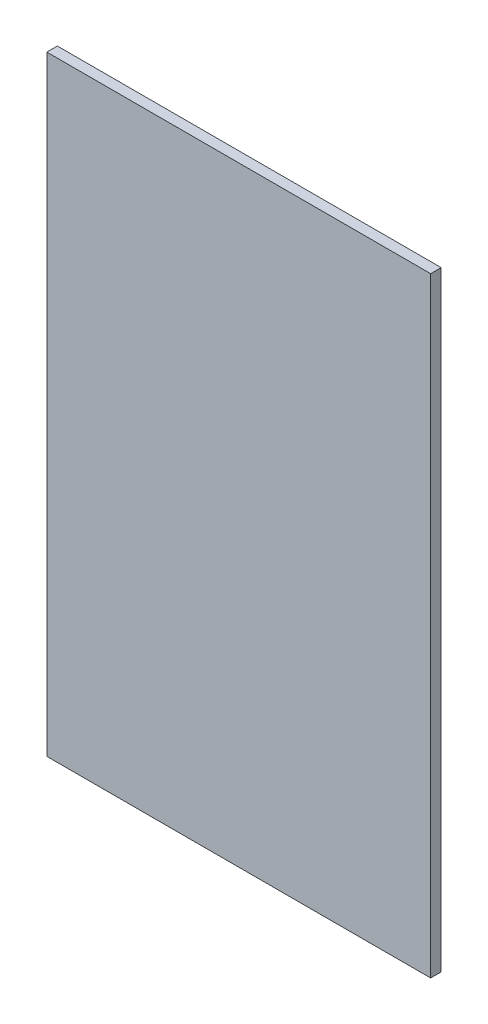
ISO-10303-21;
HEADER;
FILE_DESCRIPTION(('STEP AP214'),'2;1');
FILE_NAME('part.step','',(''),(''),'','','');
FILE_SCHEMA(('AUTOMOTIVE_DESIGN { 1 0 10303 214 1 1 1 1 }'));
ENDSEC;
DATA;
#1=APPLICATION_CONTEXT('core data for automotive mechanical design processes');
#2=APPLICATION_PROTOCOL_DEFINITION('international standard','automotive_design',2000,#1);
#3=PRODUCT_CONTEXT('',#1,'mechanical');
#4=PRODUCT('Part','Part','',(#3));
#5=PRODUCT_RELATED_PRODUCT_CATEGORY('part','',(#4));
#6=PRODUCT_DEFINITION_FORMATION('','',#4);
#7=PRODUCT_DEFINITION_CONTEXT('part definition',#1,'design');
#8=PRODUCT_DEFINITION('design','',#6,#7);
#9=PRODUCT_DEFINITION_SHAPE('','',#8);
#10=(LENGTH_UNIT() NAMED_UNIT(*) SI_UNIT(.MILLI.,.METRE.));
#11=(NAMED_UNIT(*) PLANE_ANGLE_UNIT() SI_UNIT($,.RADIAN.));
#12=(NAMED_UNIT(*) SI_UNIT($,.STERADIAN.) SOLID_ANGLE_UNIT());
#13=UNCERTAINTY_MEASURE_WITH_UNIT(LENGTH_MEASURE(1.E-05),#10,'distance_accuracy_value','');
#14=(GEOMETRIC_REPRESENTATION_CONTEXT(3) GLOBAL_UNCERTAINTY_ASSIGNED_CONTEXT((#13)) GLOBAL_UNIT_ASSIGNED_CONTEXT((#10,
#11,#12)) REPRESENTATION_CONTEXT('',''));
#15=CARTESIAN_POINT('',(0.,0.,0.));
#16=DIRECTION('',(0.,0.,1.));
#17=DIRECTION('',(1.,0.,0.));
#18=AXIS2_PLACEMENT_3D('',#15,#16,#17);
#19=CARTESIAN_POINT('',(-108.016712951374,44.5406064209275,10.));
#20=DIRECTION('',(1.,0.,0.));
#21=DIRECTION('',(0.,1.,0.));
#22=AXIS2_PLACEMENT_3D('',#19,#20,#21);
#23=PLANE('',#22);
#24=DIRECTION('',(0.,-1.,0.));
#25=VECTOR('',#24,1.);
#26=CARTESIAN_POINT('',(-108.016712951374,44.5406064209275,0.));
#27=LINE('',#26,#25);
#28=CARTESIAN_POINT('',(-108.016712951374,44.5406064209275,0.));
#29=VERTEX_POINT('',#28);
#30=CARTESIAN_POINT('',(-108.016712951374,-535.459393579072,0.));
#31=VERTEX_POINT('',#30);
#32=EDGE_CURVE('E95',#29,#31,#27,.T.);
#33=ORIENTED_EDGE('',*,*,#32,.T.);
#34=DIRECTION('',(0.,0.,-1.));
#35=VECTOR('',#34,1.);
#36=CARTESIAN_POINT('',(-108.016712951374,-535.459393579072,10.));
#37=LINE('',#36,#35);
#38=CARTESIAN_POINT('',(-108.016712951374,-535.459393579072,10.));
#39=VERTEX_POINT('',#38);
#40=EDGE_CURVE('E11',#39,#31,#37,.T.);
#41=ORIENTED_EDGE('',*,*,#40,.F.);
#42=DIRECTION('',(0.,-1.,0.));
#43=VECTOR('',#42,1.);
#44=CARTESIAN_POINT('',(-108.016712951374,44.5406064209275,10.));
#45=LINE('',#44,#43);
#46=CARTESIAN_POINT('',(-108.016712951374,44.5406064209275,10.));
#47=VERTEX_POINT('',#46);
#48=EDGE_CURVE('E83',#47,#39,#45,.T.);
#49=ORIENTED_EDGE('',*,*,#48,.F.);
#50=DIRECTION('',(0.,0.,-1.));
#51=VECTOR('',#50,1.);
#52=CARTESIAN_POINT('',(-108.016712951374,44.5406064209275,10.));
#53=LINE('',#52,#51);
#54=EDGE_CURVE('E91',#47,#29,#53,.T.);
#55=ORIENTED_EDGE('',*,*,#54,.T.);
#56=EDGE_LOOP('',(#33,#41,#49,#55));
#57=FACE_BOUND('',#56,.T.);
#58=ADVANCED_FACE('F32',(#57),#23,.F.);
#59=CARTESIAN_POINT('',(-108.016712951374,-535.459393579072,10.));
#60=DIRECTION('',(0.,1.,0.));
#61=DIRECTION('',(0.,0.,1.));
#62=AXIS2_PLACEMENT_3D('',#59,#60,#61);
#63=PLANE('',#62);
#64=DIRECTION('',(1.,0.,0.));
#65=VECTOR('',#64,1.);
#66=CARTESIAN_POINT('',(-108.016712951374,-535.459393579072,0.));
#67=LINE('',#66,#65);
#68=CARTESIAN_POINT('',(256.983287048626,-535.459393579072,0.));
#69=VERTEX_POINT('',#68);
#70=EDGE_CURVE('E87',#31,#69,#67,.T.);
#71=ORIENTED_EDGE('',*,*,#70,.T.);
#72=DIRECTION('',(0.,0.,-1.));
#73=VECTOR('',#72,1.);
#74=CARTESIAN_POINT('',(256.983287048626,-535.459393579072,10.));
#75=LINE('',#74,#73);
#76=CARTESIAN_POINT('',(256.983287048626,-535.459393579072,10.));
#77=VERTEX_POINT('',#76);
#78=EDGE_CURVE('E40',#77,#69,#75,.T.);
#79=ORIENTED_EDGE('',*,*,#78,.F.);
#80=DIRECTION('',(1.,0.,0.));
#81=VECTOR('',#80,1.);
#82=CARTESIAN_POINT('',(-108.016712951374,-535.459393579072,10.));
#83=LINE('',#82,#81);
#84=EDGE_CURVE('E78',#39,#77,#83,.T.);
#85=ORIENTED_EDGE('',*,*,#84,.F.);
#86=ORIENTED_EDGE('',*,*,#40,.T.);
#87=EDGE_LOOP('',(#71,#79,#85,#86));
#88=FACE_BOUND('',#87,.T.);
#89=ADVANCED_FACE('F86',(#88),#63,.F.);
#90=CARTESIAN_POINT('',(256.983287048626,44.5406064209275,10.));
#91=DIRECTION('',(-1.,0.,0.));
#92=DIRECTION('',(0.,0.,1.));
#93=AXIS2_PLACEMENT_3D('',#90,#91,#92);
#94=PLANE('',#93);
#95=DIRECTION('',(0.,1.,0.));
#96=VECTOR('',#95,1.);
#97=CARTESIAN_POINT('',(256.983287048626,44.5406064209275,0.));
#98=LINE('',#97,#96);
#99=CARTESIAN_POINT('',(256.983287048626,44.5406064209275,0.));
#100=VERTEX_POINT('',#99);
#101=EDGE_CURVE('E65',#69,#100,#98,.T.);
#102=ORIENTED_EDGE('',*,*,#101,.T.);
#103=DIRECTION('',(0.,0.,-1.));
#104=VECTOR('',#103,1.);
#105=CARTESIAN_POINT('',(256.983287048626,44.5406064209275,10.));
#106=LINE('',#105,#104);
#107=CARTESIAN_POINT('',(256.983287048626,44.5406064209275,10.));
#108=VERTEX_POINT('',#107);
#109=EDGE_CURVE('E88',#108,#100,#106,.T.);
#110=ORIENTED_EDGE('',*,*,#109,.F.);
#111=DIRECTION('',(0.,1.,0.));
#112=VECTOR('',#111,1.);
#113=CARTESIAN_POINT('',(256.983287048626,44.5406064209275,10.));
#114=LINE('',#113,#112);
#115=EDGE_CURVE('E81',#77,#108,#114,.T.);
#116=ORIENTED_EDGE('',*,*,#115,.F.);
#117=ORIENTED_EDGE('',*,*,#78,.T.);
#118=EDGE_LOOP('',(#102,#110,#116,#117));
#119=FACE_BOUND('',#118,.T.);
#120=ADVANCED_FACE('F89',(#119),#94,.F.);
#121=CARTESIAN_POINT('',(-108.016712951374,44.5406064209275,10.));
#122=DIRECTION('',(0.,-1.,0.));
#123=DIRECTION('',(0.,0.,-1.));
#124=AXIS2_PLACEMENT_3D('',#121,#122,#123);
#125=PLANE('',#124);
#126=DIRECTION('',(-1.,0.,0.));
#127=VECTOR('',#126,1.);
#128=CARTESIAN_POINT('',(-108.016712951374,44.5406064209275,0.));
#129=LINE('',#128,#127);
#130=EDGE_CURVE('E71',#100,#29,#129,.T.);
#131=ORIENTED_EDGE('',*,*,#130,.T.);
#132=ORIENTED_EDGE('',*,*,#54,.F.);
#133=DIRECTION('',(-1.,0.,0.));
#134=VECTOR('',#133,1.);
#135=CARTESIAN_POINT('',(-108.016712951374,44.5406064209275,10.));
#136=LINE('',#135,#134);
#137=EDGE_CURVE('E48',#108,#47,#136,.T.);
#138=ORIENTED_EDGE('',*,*,#137,.F.);
#139=ORIENTED_EDGE('',*,*,#109,.T.);
#140=EDGE_LOOP('',(#131,#132,#138,#139));
#141=FACE_BOUND('',#140,.T.);
#142=ADVANCED_FACE('F102',(#141),#125,.F.);
#143=CARTESIAN_POINT('',(0.,0.,10.));
#144=DIRECTION('',(0.,0.,1.));
#145=DIRECTION('',(1.,0.,0.));
#146=AXIS2_PLACEMENT_3D('',#143,#144,#145);
#147=PLANE('',#146);
#148=ORIENTED_EDGE('',*,*,#48,.T.);
#149=ORIENTED_EDGE('',*,*,#84,.T.);
#150=ORIENTED_EDGE('',*,*,#115,.T.);
#151=ORIENTED_EDGE('',*,*,#137,.T.);
#152=EDGE_LOOP('',(#148,#149,#150,#151));
#153=FACE_BOUND('',#152,.T.);
#154=ADVANCED_FACE('F79',(#153),#147,.T.);
#155=CARTESIAN_POINT('',(0.,0.,0.));
#156=DIRECTION('',(0.,0.,1.));
#157=DIRECTION('',(1.,0.,0.));
#158=AXIS2_PLACEMENT_3D('',#155,#156,#157);
#159=PLANE('',#158);
#160=ORIENTED_EDGE('',*,*,#32,.F.);
#161=ORIENTED_EDGE('',*,*,#130,.F.);
#162=ORIENTED_EDGE('',*,*,#101,.F.);
#163=ORIENTED_EDGE('',*,*,#70,.F.);
#164=EDGE_LOOP('',(#160,#161,#162,#163));
#165=FACE_BOUND('',#164,.T.);
#166=ADVANCED_FACE('F105',(#165),#159,.F.);
#167=CLOSED_SHELL('',(#58,#89,#120,#142,#154,#166));
#168=MANIFOLD_SOLID_BREP('B2',#167);
#169=ADVANCED_BREP_SHAPE_REPRESENTATION('',(#18,#168),#14);
#170=SHAPE_DEFINITION_REPRESENTATION(#9,#169);
ENDSEC;
END-ISO-10303-21;
